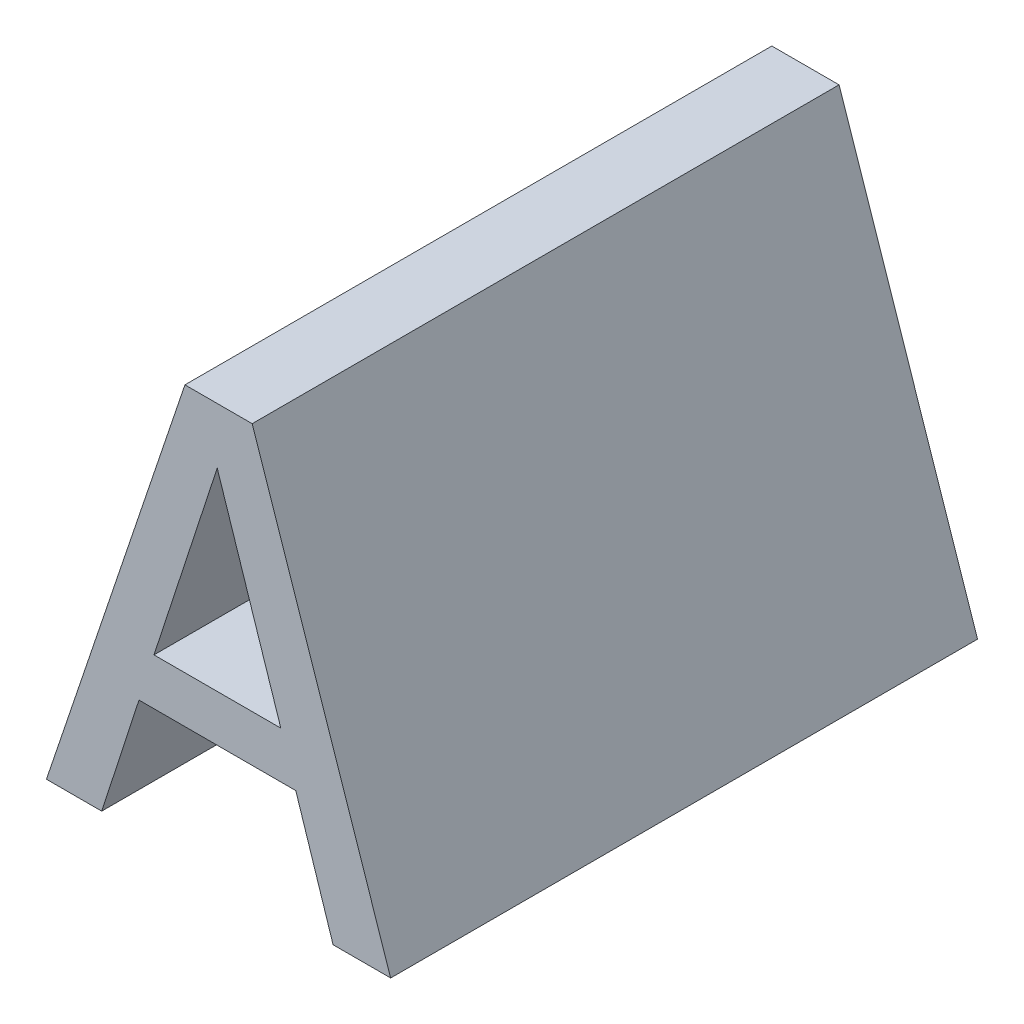
ISO-10303-21;
HEADER;
FILE_DESCRIPTION(('STEP AP214'),'2;1');
FILE_NAME('part.step','',(''),(''),'','','');
FILE_SCHEMA(('AUTOMOTIVE_DESIGN { 1 0 10303 214 1 1 1 1 }'));
ENDSEC;
DATA;
#1=APPLICATION_CONTEXT('core data for automotive mechanical design processes');
#2=APPLICATION_PROTOCOL_DEFINITION('international standard','automotive_design',2000,#1);
#3=PRODUCT_CONTEXT('',#1,'mechanical');
#4=PRODUCT('Part','Part','',(#3));
#5=PRODUCT_RELATED_PRODUCT_CATEGORY('part','',(#4));
#6=PRODUCT_DEFINITION_FORMATION('','',#4);
#7=PRODUCT_DEFINITION_CONTEXT('part definition',#1,'design');
#8=PRODUCT_DEFINITION('design','',#6,#7);
#9=PRODUCT_DEFINITION_SHAPE('','',#8);
#10=(LENGTH_UNIT() NAMED_UNIT(*) SI_UNIT(.MILLI.,.METRE.));
#11=(NAMED_UNIT(*) PLANE_ANGLE_UNIT() SI_UNIT($,.RADIAN.));
#12=(NAMED_UNIT(*) SI_UNIT($,.STERADIAN.) SOLID_ANGLE_UNIT());
#13=UNCERTAINTY_MEASURE_WITH_UNIT(LENGTH_MEASURE(1.E-05),#10,'distance_accuracy_value','');
#14=(GEOMETRIC_REPRESENTATION_CONTEXT(3) GLOBAL_UNCERTAINTY_ASSIGNED_CONTEXT((#13)) GLOBAL_UNIT_ASSIGNED_CONTEXT((#10,
#11,#12)) REPRESENTATION_CONTEXT('',''));
#15=CARTESIAN_POINT('',(0.,0.,0.));
#16=DIRECTION('',(0.,0.,1.));
#17=DIRECTION('',(1.,0.,0.));
#18=AXIS2_PLACEMENT_3D('',#15,#16,#17);
#19=CARTESIAN_POINT('',(0.230158536593232,-0.544402441218897,0.));
#20=DIRECTION('',(0.,-1.,0.));
#21=DIRECTION('',(1.,0.,0.));
#22=AXIS2_PLACEMENT_3D('',#19,#20,#21);
#23=PLANE('',#22);
#24=DIRECTION('',(1.,0.,0.));
#25=VECTOR('',#24,1.);
#26=CARTESIAN_POINT('',(0.230158536593232,-0.544402441218897,0.));
#27=LINE('',#26,#25);
#28=CARTESIAN_POINT('',(0.230158536593232,-0.544402441218897,0.));
#29=VERTEX_POINT('',#28);
#30=CARTESIAN_POINT('',(0.251771179075577,-0.544402441218897,0.));
#31=VERTEX_POINT('',#30);
#32=EDGE_CURVE('E11',#29,#31,#27,.T.);
#33=ORIENTED_EDGE('',*,*,#32,.F.);
#34=DIRECTION('',(0.,0.,1.));
#35=VECTOR('',#34,1.);
#36=CARTESIAN_POINT('',(0.230158536593232,-0.544402441218897,0.));
#37=LINE('',#36,#35);
#38=CARTESIAN_POINT('',(0.230158536593232,-0.544402441218897,0.1));
#39=VERTEX_POINT('',#38);
#40=EDGE_CURVE('E190',#29,#39,#37,.T.);
#41=ORIENTED_EDGE('',*,*,#40,.T.);
#42=DIRECTION('',(-1.,0.,0.));
#43=VECTOR('',#42,1.);
#44=CARTESIAN_POINT('',(0.251771179075577,-0.544402441218897,0.1));
#45=LINE('',#44,#43);
#46=CARTESIAN_POINT('',(0.251771179075577,-0.544402441218897,0.1));
#47=VERTEX_POINT('',#46);
#48=EDGE_CURVE('E182',#47,#39,#45,.T.);
#49=ORIENTED_EDGE('',*,*,#48,.F.);
#50=DIRECTION('',(0.,0.,1.));
#51=VECTOR('',#50,1.);
#52=CARTESIAN_POINT('',(0.251771179075577,-0.544402441218897,0.));
#53=LINE('',#52,#51);
#54=EDGE_CURVE('E176',#31,#47,#53,.T.);
#55=ORIENTED_EDGE('',*,*,#54,.F.);
#56=EDGE_LOOP('',(#33,#41,#49,#55));
#57=FACE_BOUND('',#56,.T.);
#58=ADVANCED_FACE('F17',(#57),#23,.F.);
#59=CARTESIAN_POINT('',(0.240936494786527,-0.511444579585714,0.));
#60=DIRECTION('',(-0.950467445728689,0.31082412166687,0.));
#61=DIRECTION('',(-0.31082412166687,-0.950467445728689,0.));
#62=AXIS2_PLACEMENT_3D('',#59,#60,#61);
#63=PLANE('',#62);
#64=DIRECTION('',(-0.310824121666869,-0.95046744572869,0.));
#65=VECTOR('',#64,1.);
#66=CARTESIAN_POINT('',(0.240936494786527,-0.511444579585714,0.));
#67=LINE('',#66,#65);
#68=CARTESIAN_POINT('',(0.240936494786527,-0.511444579585714,0.));
#69=VERTEX_POINT('',#68);
#70=EDGE_CURVE('E24',#69,#29,#67,.T.);
#71=ORIENTED_EDGE('',*,*,#70,.F.);
#72=DIRECTION('',(0.,0.,1.));
#73=VECTOR('',#72,1.);
#74=CARTESIAN_POINT('',(0.240936494786527,-0.511444579585714,0.));
#75=LINE('',#74,#73);
#76=CARTESIAN_POINT('',(0.240936494786527,-0.511444579585714,0.1));
#77=VERTEX_POINT('',#76);
#78=EDGE_CURVE('E185',#69,#77,#75,.T.);
#79=ORIENTED_EDGE('',*,*,#78,.T.);
#80=DIRECTION('',(0.31082412166687,0.950467445728689,0.));
#81=VECTOR('',#80,1.);
#82=CARTESIAN_POINT('',(0.230158536593231,-0.544402441218897,0.1));
#83=LINE('',#82,#81);
#84=EDGE_CURVE('E173',#39,#77,#83,.T.);
#85=ORIENTED_EDGE('',*,*,#84,.F.);
#86=ORIENTED_EDGE('',*,*,#40,.F.);
#87=EDGE_LOOP('',(#71,#79,#85,#86));
#88=FACE_BOUND('',#87,.T.);
#89=ADVANCED_FACE('F197',(#88),#63,.F.);
#90=CARTESIAN_POINT('',(0.251771179075577,-0.544402441218897,0.));
#91=DIRECTION('',(0.949983248285707,0.312300861312513,0.));
#92=DIRECTION('',(-0.312300861312513,0.949983248285707,0.));
#93=AXIS2_PLACEMENT_3D('',#90,#91,#92);
#94=PLANE('',#93);
#95=DIRECTION('',(-0.312300861312512,0.949983248285707,0.));
#96=VECTOR('',#95,1.);
#97=CARTESIAN_POINT('',(0.251771179075577,-0.544402441218897,0.));
#98=LINE('',#97,#96);
#99=EDGE_CURVE('E187',#31,#69,#98,.T.);
#100=ORIENTED_EDGE('',*,*,#99,.F.);
#101=ORIENTED_EDGE('',*,*,#54,.T.);
#102=DIRECTION('',(0.312300861312514,-0.949983248285706,0.));
#103=VECTOR('',#102,1.);
#104=CARTESIAN_POINT('',(0.240936494786527,-0.511444579585714,0.1));
#105=LINE('',#104,#103);
#106=EDGE_CURVE('E165',#77,#47,#105,.T.);
#107=ORIENTED_EDGE('',*,*,#106,.F.);
#108=ORIENTED_EDGE('',*,*,#78,.F.);
#109=EDGE_LOOP('',(#100,#101,#107,#108));
#110=FACE_BOUND('',#109,.T.);
#111=ADVANCED_FACE('F194',(#110),#94,.F.);
#112=CARTESIAN_POINT('',(0.246892734840717,-0.50191459549901,0.));
#113=DIRECTION('',(0.,1.,0.));
#114=DIRECTION('',(-1.,0.,0.));
#115=AXIS2_PLACEMENT_3D('',#112,#113,#114);
#116=PLANE('',#115);
#117=DIRECTION('',(1.,0.,0.));
#118=VECTOR('',#117,1.);
#119=CARTESIAN_POINT('',(0.235434063498371,-0.50191459549901,0.));
#120=LINE('',#119,#118);
#121=CARTESIAN_POINT('',(0.235434063498371,-0.50191459549901,0.));
#122=VERTEX_POINT('',#121);
#123=CARTESIAN_POINT('',(0.246892734840717,-0.50191459549901,0.));
#124=VERTEX_POINT('',#123);
#125=EDGE_CURVE('E179',#122,#124,#120,.T.);
#126=ORIENTED_EDGE('',*,*,#125,.F.);
#127=DIRECTION('',(0.,0.,1.));
#128=VECTOR('',#127,1.);
#129=CARTESIAN_POINT('',(0.235434063498371,-0.50191459549901,0.));
#130=LINE('',#129,#128);
#131=CARTESIAN_POINT('',(0.235434063498371,-0.50191459549901,0.1));
#132=VERTEX_POINT('',#131);
#133=EDGE_CURVE('E168',#122,#132,#130,.T.);
#134=ORIENTED_EDGE('',*,*,#133,.T.);
#135=DIRECTION('',(-1.,0.,0.));
#136=VECTOR('',#135,1.);
#137=CARTESIAN_POINT('',(0.246892734840717,-0.50191459549901,0.1));
#138=LINE('',#137,#136);
#139=CARTESIAN_POINT('',(0.246892734840717,-0.50191459549901,0.1));
#140=VERTEX_POINT('',#139);
#141=EDGE_CURVE('E123',#140,#132,#138,.T.);
#142=ORIENTED_EDGE('',*,*,#141,.F.);
#143=DIRECTION('',(0.,0.,1.));
#144=VECTOR('',#143,1.);
#145=CARTESIAN_POINT('',(0.246892734840717,-0.50191459549901,0.));
#146=LINE('',#145,#144);
#147=EDGE_CURVE('E160',#124,#140,#146,.T.);
#148=ORIENTED_EDGE('',*,*,#147,.F.);
#149=EDGE_LOOP('',(#126,#134,#142,#148));
#150=FACE_BOUND('',#149,.T.);
#151=ADVANCED_FACE('F204',(#150),#116,.T.);
#152=CARTESIAN_POINT('',(0.270490790674459,-0.571914597659679,0.));
#153=DIRECTION('',(0.947602739606771,0.319451166674568,0.));
#154=DIRECTION('',(-0.319451166674568,0.947602739606771,0.));
#155=AXIS2_PLACEMENT_3D('',#152,#153,#154);
#156=PLANE('',#155);
#157=DIRECTION('',(0.319451166674568,-0.947602739606771,0.));
#158=VECTOR('',#157,1.);
#159=CARTESIAN_POINT('',(0.246892734840717,-0.50191459549901,0.));
#160=LINE('',#159,#158);
#161=CARTESIAN_POINT('',(0.270490790674459,-0.571914597659679,0.));
#162=VERTEX_POINT('',#161);
#163=EDGE_CURVE('E170',#124,#162,#160,.T.);
#164=ORIENTED_EDGE('',*,*,#163,.F.);
#165=ORIENTED_EDGE('',*,*,#147,.T.);
#166=DIRECTION('',(-0.319451166674569,0.947602739606771,0.));
#167=VECTOR('',#166,1.);
#168=CARTESIAN_POINT('',(0.27049079067446,-0.571914597659679,0.1));
#169=LINE('',#168,#167);
#170=CARTESIAN_POINT('',(0.270490790674459,-0.571914597659679,0.1));
#171=VERTEX_POINT('',#170);
#172=EDGE_CURVE('E152',#171,#140,#169,.T.);
#173=ORIENTED_EDGE('',*,*,#172,.F.);
#174=DIRECTION('',(0.,0.,1.));
#175=VECTOR('',#174,1.);
#176=CARTESIAN_POINT('',(0.270490790674459,-0.571914597659679,0.));
#177=LINE('',#176,#175);
#178=EDGE_CURVE('E154',#162,#171,#177,.T.);
#179=ORIENTED_EDGE('',*,*,#178,.F.);
#180=EDGE_LOOP('',(#164,#165,#173,#179));
#181=FACE_BOUND('',#180,.T.);
#182=ADVANCED_FACE('F212',(#181),#156,.T.);
#183=CARTESIAN_POINT('',(0.260677176108985,-0.571914597659679,0.));
#184=DIRECTION('',(0.,-1.,0.));
#185=DIRECTION('',(1.,0.,0.));
#186=AXIS2_PLACEMENT_3D('',#183,#184,#185);
#187=PLANE('',#186);
#188=DIRECTION('',(-1.,0.,0.));
#189=VECTOR('',#188,1.);
#190=CARTESIAN_POINT('',(0.270490790674459,-0.571914597659679,0.));
#191=LINE('',#190,#189);
#192=CARTESIAN_POINT('',(0.260677176108985,-0.571914597659679,0.));
#193=VERTEX_POINT('',#192);
#194=EDGE_CURVE('E162',#162,#193,#191,.T.);
#195=ORIENTED_EDGE('',*,*,#194,.F.);
#196=ORIENTED_EDGE('',*,*,#178,.T.);
#197=DIRECTION('',(1.,0.,0.));
#198=VECTOR('',#197,1.);
#199=CARTESIAN_POINT('',(0.260677176108985,-0.571914597659679,0.1));
#200=LINE('',#199,#198);
#201=CARTESIAN_POINT('',(0.260677176108985,-0.571914597659679,0.1));
#202=VERTEX_POINT('',#201);
#203=EDGE_CURVE('E144',#202,#171,#200,.T.);
#204=ORIENTED_EDGE('',*,*,#203,.F.);
#205=DIRECTION('',(0.,0.,1.));
#206=VECTOR('',#205,1.);
#207=CARTESIAN_POINT('',(0.260677176108985,-0.571914597659679,0.));
#208=LINE('',#207,#206);
#209=EDGE_CURVE('E147',#193,#202,#208,.T.);
#210=ORIENTED_EDGE('',*,*,#209,.F.);
#211=EDGE_LOOP('',(#195,#196,#204,#210));
#212=FACE_BOUND('',#211,.T.);
#213=ADVANCED_FACE('F218',(#212),#187,.T.);
#214=CARTESIAN_POINT('',(0.254323853384516,-0.552344094624484,0.));
#215=DIRECTION('',(-0.951135317488762,-0.30877436393838,0.));
#216=DIRECTION('',(0.30877436393838,-0.951135317488762,0.));
#217=AXIS2_PLACEMENT_3D('',#214,#215,#216);
#218=PLANE('',#217);
#219=DIRECTION('',(-0.30877436393838,0.951135317488762,0.));
#220=VECTOR('',#219,1.);
#221=CARTESIAN_POINT('',(0.260677176108985,-0.571914597659679,0.));
#222=LINE('',#221,#220);
#223=CARTESIAN_POINT('',(0.254323853384516,-0.552344094624484,0.));
#224=VERTEX_POINT('',#223);
#225=EDGE_CURVE('E156',#193,#224,#222,.T.);
#226=ORIENTED_EDGE('',*,*,#225,.F.);
#227=ORIENTED_EDGE('',*,*,#209,.T.);
#228=DIRECTION('',(0.308774363938379,-0.951135317488763,0.));
#229=VECTOR('',#228,1.);
#230=CARTESIAN_POINT('',(0.254323853384516,-0.552344094624484,0.1));
#231=LINE('',#230,#229);
#232=CARTESIAN_POINT('',(0.254323853384516,-0.552344094624484,0.1));
#233=VERTEX_POINT('',#232);
#234=EDGE_CURVE('E136',#233,#202,#231,.T.);
#235=ORIENTED_EDGE('',*,*,#234,.F.);
#236=DIRECTION('',(0.,0.,1.));
#237=VECTOR('',#236,1.);
#238=CARTESIAN_POINT('',(0.254323853384516,-0.552344094624484,0.));
#239=LINE('',#238,#237);
#240=EDGE_CURVE('E139',#224,#233,#239,.T.);
#241=ORIENTED_EDGE('',*,*,#240,.F.);
#242=EDGE_LOOP('',(#226,#227,#235,#241));
#243=FACE_BOUND('',#242,.T.);
#244=ADVANCED_FACE('F222',(#243),#218,.T.);
#245=CARTESIAN_POINT('',(0.227605862284293,-0.552344094624484,0.));
#246=DIRECTION('',(0.,-1.,0.));
#247=DIRECTION('',(1.,0.,0.));
#248=AXIS2_PLACEMENT_3D('',#245,#246,#247);
#249=PLANE('',#248);
#250=DIRECTION('',(-1.,0.,0.));
#251=VECTOR('',#250,1.);
#252=CARTESIAN_POINT('',(0.254323853384516,-0.552344094624484,0.));
#253=LINE('',#252,#251);
#254=CARTESIAN_POINT('',(0.227605862284293,-0.552344094624484,0.));
#255=VERTEX_POINT('',#254);
#256=EDGE_CURVE('E149',#224,#255,#253,.T.);
#257=ORIENTED_EDGE('',*,*,#256,.F.);
#258=ORIENTED_EDGE('',*,*,#240,.T.);
#259=DIRECTION('',(1.,0.,0.));
#260=VECTOR('',#259,1.);
#261=CARTESIAN_POINT('',(0.227605862284293,-0.552344094624484,0.1));
#262=LINE('',#261,#260);
#263=CARTESIAN_POINT('',(0.227605862284293,-0.552344094624484,0.1));
#264=VERTEX_POINT('',#263);
#265=EDGE_CURVE('E129',#264,#233,#262,.T.);
#266=ORIENTED_EDGE('',*,*,#265,.F.);
#267=DIRECTION('',(0.,0.,1.));
#268=VECTOR('',#267,1.);
#269=CARTESIAN_POINT('',(0.227605862284293,-0.552344094624484,0.));
#270=LINE('',#269,#268);
#271=EDGE_CURVE('E132',#255,#264,#270,.T.);
#272=ORIENTED_EDGE('',*,*,#271,.F.);
#273=EDGE_LOOP('',(#257,#258,#266,#272));
#274=FACE_BOUND('',#273,.T.);
#275=ADVANCED_FACE('F228',(#274),#249,.T.);
#276=CARTESIAN_POINT('',(0.221252539559824,-0.571914597659679,0.));
#277=DIRECTION('',(0.951135317488762,-0.30877436393838,0.));
#278=DIRECTION('',(0.30877436393838,0.951135317488762,0.));
#279=AXIS2_PLACEMENT_3D('',#276,#277,#278);
#280=PLANE('',#279);
#281=DIRECTION('',(-0.30877436393838,-0.951135317488762,0.));
#282=VECTOR('',#281,1.);
#283=CARTESIAN_POINT('',(0.227605862284293,-0.552344094624484,0.));
#284=LINE('',#283,#282);
#285=CARTESIAN_POINT('',(0.221252539559824,-0.571914597659679,0.));
#286=VERTEX_POINT('',#285);
#287=EDGE_CURVE('E141',#255,#286,#284,.T.);
#288=ORIENTED_EDGE('',*,*,#287,.F.);
#289=ORIENTED_EDGE('',*,*,#271,.T.);
#290=DIRECTION('',(0.30877436393838,0.951135317488762,0.));
#291=VECTOR('',#290,1.);
#292=CARTESIAN_POINT('',(0.221252539559824,-0.571914597659679,0.1));
#293=LINE('',#292,#291);
#294=CARTESIAN_POINT('',(0.221252539559824,-0.571914597659679,0.1));
#295=VERTEX_POINT('',#294);
#296=EDGE_CURVE('E108',#295,#264,#293,.T.);
#297=ORIENTED_EDGE('',*,*,#296,.F.);
#298=DIRECTION('',(0.,0.,1.));
#299=VECTOR('',#298,1.);
#300=CARTESIAN_POINT('',(0.221252539559824,-0.571914597659679,0.));
#301=LINE('',#300,#299);
#302=EDGE_CURVE('E114',#286,#295,#301,.T.);
#303=ORIENTED_EDGE('',*,*,#302,.F.);
#304=EDGE_LOOP('',(#288,#289,#297,#303));
#305=FACE_BOUND('',#304,.T.);
#306=ADVANCED_FACE('F232',(#305),#280,.T.);
#307=CARTESIAN_POINT('',(0.211836007664629,-0.571914597659679,0.));
#308=DIRECTION('',(0.,-1.,0.));
#309=DIRECTION('',(1.,0.,0.));
#310=AXIS2_PLACEMENT_3D('',#307,#308,#309);
#311=PLANE('',#310);
#312=DIRECTION('',(-1.,0.,0.));
#313=VECTOR('',#312,1.);
#314=CARTESIAN_POINT('',(0.221252539559824,-0.571914597659679,0.));
#315=LINE('',#314,#313);
#316=CARTESIAN_POINT('',(0.211836007664629,-0.571914597659679,0.));
#317=VERTEX_POINT('',#316);
#318=EDGE_CURVE('E134',#286,#317,#315,.T.);
#319=ORIENTED_EDGE('',*,*,#318,.F.);
#320=ORIENTED_EDGE('',*,*,#302,.T.);
#321=DIRECTION('',(1.,0.,0.));
#322=VECTOR('',#321,1.);
#323=CARTESIAN_POINT('',(0.211836007664629,-0.571914597659679,0.1));
#324=LINE('',#323,#322);
#325=CARTESIAN_POINT('',(0.211836007664629,-0.571914597659679,0.1));
#326=VERTEX_POINT('',#325);
#327=EDGE_CURVE('E109',#326,#295,#324,.T.);
#328=ORIENTED_EDGE('',*,*,#327,.F.);
#329=DIRECTION('',(0.,0.,1.));
#330=VECTOR('',#329,1.);
#331=CARTESIAN_POINT('',(0.211836007664629,-0.571914597659679,0.));
#332=LINE('',#331,#330);
#333=EDGE_CURVE('E97',#317,#326,#332,.T.);
#334=ORIENTED_EDGE('',*,*,#333,.F.);
#335=EDGE_LOOP('',(#319,#320,#328,#334));
#336=FACE_BOUND('',#335,.T.);
#337=ADVANCED_FACE('F112',(#336),#311,.T.);
#338=CARTESIAN_POINT('',(0.235434063498371,-0.50191459549901,0.));
#339=DIRECTION('',(-0.947602739606771,0.319451166674568,0.));
#340=DIRECTION('',(-0.319451166674568,-0.947602739606771,0.));
#341=AXIS2_PLACEMENT_3D('',#338,#339,#340);
#342=PLANE('',#341);
#343=DIRECTION('',(0.319451166674568,0.947602739606771,0.));
#344=VECTOR('',#343,1.);
#345=CARTESIAN_POINT('',(0.211836007664629,-0.571914597659679,0.));
#346=LINE('',#345,#344);
#347=EDGE_CURVE('E105',#317,#122,#346,.T.);
#348=ORIENTED_EDGE('',*,*,#347,.F.);
#349=ORIENTED_EDGE('',*,*,#333,.T.);
#350=DIRECTION('',(-0.319451166674569,-0.94760273960677,0.));
#351=VECTOR('',#350,1.);
#352=CARTESIAN_POINT('',(0.235434063498372,-0.50191459549901,0.1));
#353=LINE('',#352,#351);
#354=EDGE_CURVE('E102',#132,#326,#353,.T.);
#355=ORIENTED_EDGE('',*,*,#354,.F.);
#356=ORIENTED_EDGE('',*,*,#133,.F.);
#357=EDGE_LOOP('',(#348,#349,#355,#356));
#358=FACE_BOUND('',#357,.T.);
#359=ADVANCED_FACE('F99',(#358),#342,.T.);
#360=CARTESIAN_POINT('',(0.241140469586137,-0.543905589932933,0.));
#361=DIRECTION('',(0.,0.,1.));
#362=DIRECTION('',(1.,0.,0.));
#363=AXIS2_PLACEMENT_3D('',#360,#361,#362);
#364=PLANE('',#363);
#365=ORIENTED_EDGE('',*,*,#347,.T.);
#366=ORIENTED_EDGE('',*,*,#125,.T.);
#367=ORIENTED_EDGE('',*,*,#163,.T.);
#368=ORIENTED_EDGE('',*,*,#194,.T.);
#369=ORIENTED_EDGE('',*,*,#225,.T.);
#370=ORIENTED_EDGE('',*,*,#256,.T.);
#371=ORIENTED_EDGE('',*,*,#287,.T.);
#372=ORIENTED_EDGE('',*,*,#318,.T.);
#373=EDGE_LOOP('',(#365,#366,#367,#368,#369,#370,#371,#372));
#374=FACE_BOUND('',#373,.T.);
#375=ORIENTED_EDGE('',*,*,#32,.T.);
#376=ORIENTED_EDGE('',*,*,#99,.T.);
#377=ORIENTED_EDGE('',*,*,#70,.T.);
#378=EDGE_LOOP('',(#375,#376,#377));
#379=FACE_BOUND('',#378,.T.);
#380=ADVANCED_FACE('F192',(#374,#379),#364,.F.);
#381=CARTESIAN_POINT('',(0.241140469586137,-0.543905589932933,0.1));
#382=DIRECTION('',(0.,0.,1.));
#383=DIRECTION('',(1.,0.,0.));
#384=AXIS2_PLACEMENT_3D('',#381,#382,#383);
#385=PLANE('',#384);
#386=ORIENTED_EDGE('',*,*,#354,.T.);
#387=ORIENTED_EDGE('',*,*,#327,.T.);
#388=ORIENTED_EDGE('',*,*,#296,.T.);
#389=ORIENTED_EDGE('',*,*,#265,.T.);
#390=ORIENTED_EDGE('',*,*,#234,.T.);
#391=ORIENTED_EDGE('',*,*,#203,.T.);
#392=ORIENTED_EDGE('',*,*,#172,.T.);
#393=ORIENTED_EDGE('',*,*,#141,.T.);
#394=EDGE_LOOP('',(#386,#387,#388,#389,#390,#391,#392,#393));
#395=FACE_BOUND('',#394,.T.);
#396=ORIENTED_EDGE('',*,*,#48,.T.);
#397=ORIENTED_EDGE('',*,*,#84,.T.);
#398=ORIENTED_EDGE('',*,*,#106,.T.);
#399=EDGE_LOOP('',(#396,#397,#398));
#400=FACE_BOUND('',#399,.T.);
#401=ADVANCED_FACE('F119',(#395,#400),#385,.T.);
#402=CLOSED_SHELL('',(#58,#89,#111,#151,#182,#213,#244,#275,#306,#337,#359,#380,#401));
#403=MANIFOLD_SOLID_BREP('B1',#402);
#404=ADVANCED_BREP_SHAPE_REPRESENTATION('',(#18,#403),#14);
#405=SHAPE_DEFINITION_REPRESENTATION(#9,#404);
ENDSEC;
END-ISO-10303-21;
